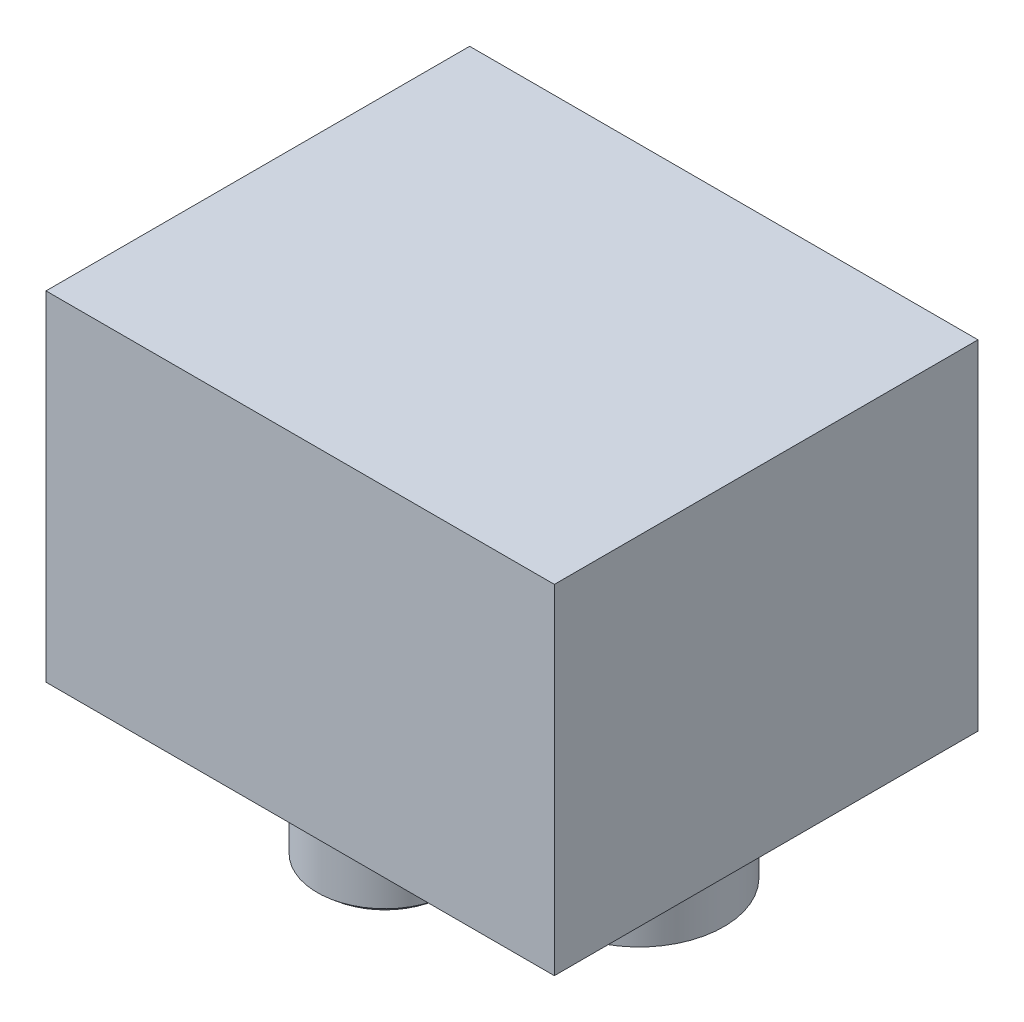
ISO-10303-21;
HEADER;
FILE_DESCRIPTION(('STEP AP214'),'2;1');
FILE_NAME('part.step','',(''),(''),'','','');
FILE_SCHEMA(('AUTOMOTIVE_DESIGN { 1 0 10303 214 1 1 1 1 }'));
ENDSEC;
DATA;
#1=APPLICATION_CONTEXT('core data for automotive mechanical design processes');
#2=APPLICATION_PROTOCOL_DEFINITION('international standard','automotive_design',2000,#1);
#3=PRODUCT_CONTEXT('',#1,'mechanical');
#4=PRODUCT('Part','Part','',(#3));
#5=PRODUCT_RELATED_PRODUCT_CATEGORY('part','',(#4));
#6=PRODUCT_DEFINITION_FORMATION('','',#4);
#7=PRODUCT_DEFINITION_CONTEXT('part definition',#1,'design');
#8=PRODUCT_DEFINITION('design','',#6,#7);
#9=PRODUCT_DEFINITION_SHAPE('','',#8);
#10=(LENGTH_UNIT() NAMED_UNIT(*) SI_UNIT(.MILLI.,.METRE.));
#11=(NAMED_UNIT(*) PLANE_ANGLE_UNIT() SI_UNIT($,.RADIAN.));
#12=(NAMED_UNIT(*) SI_UNIT($,.STERADIAN.) SOLID_ANGLE_UNIT());
#13=UNCERTAINTY_MEASURE_WITH_UNIT(LENGTH_MEASURE(1.E-05),#10,'distance_accuracy_value','');
#14=(GEOMETRIC_REPRESENTATION_CONTEXT(3) GLOBAL_UNCERTAINTY_ASSIGNED_CONTEXT((#13)) GLOBAL_UNIT_ASSIGNED_CONTEXT((#10,
#11,#12)) REPRESENTATION_CONTEXT('',''));
#15=CARTESIAN_POINT('',(0.,0.,0.));
#16=DIRECTION('',(0.,0.,1.));
#17=DIRECTION('',(1.,0.,0.));
#18=AXIS2_PLACEMENT_3D('',#15,#16,#17);
#19=CARTESIAN_POINT('',(0.,0.,31.75));
#20=DIRECTION('',(1.,0.,0.));
#21=DIRECTION('',(0.,0.,-1.));
#22=AXIS2_PLACEMENT_3D('',#19,#20,#21);
#23=PLANE('',#22);
#24=DIRECTION('',(0.,-1.,0.));
#25=VECTOR('',#24,1.);
#26=CARTESIAN_POINT('',(0.,0.,-31.75));
#27=LINE('',#26,#25);
#28=CARTESIAN_POINT('',(0.,50.8,-31.75));
#29=VERTEX_POINT('',#28);
#30=CARTESIAN_POINT('',(0.,0.,-31.75));
#31=VERTEX_POINT('',#30);
#32=EDGE_CURVE('E131',#29,#31,#27,.T.);
#33=ORIENTED_EDGE('',*,*,#32,.T.);
#34=DIRECTION('',(0.,0.,-1.));
#35=VECTOR('',#34,1.);
#36=CARTESIAN_POINT('',(0.,0.,31.75));
#37=LINE('',#36,#35);
#38=CARTESIAN_POINT('',(0.,0.,31.75));
#39=VERTEX_POINT('',#38);
#40=EDGE_CURVE('E60',#39,#31,#37,.T.);
#41=ORIENTED_EDGE('',*,*,#40,.F.);
#42=DIRECTION('',(0.,-1.,0.));
#43=VECTOR('',#42,1.);
#44=CARTESIAN_POINT('',(0.,0.,31.75));
#45=LINE('',#44,#43);
#46=CARTESIAN_POINT('',(0.,50.8,31.75));
#47=VERTEX_POINT('',#46);
#48=EDGE_CURVE('E132',#47,#39,#45,.T.);
#49=ORIENTED_EDGE('',*,*,#48,.F.);
#50=DIRECTION('',(0.,0.,-1.));
#51=VECTOR('',#50,1.);
#52=CARTESIAN_POINT('',(0.,50.8,31.75));
#53=LINE('',#52,#51);
#54=EDGE_CURVE('E142',#47,#29,#53,.T.);
#55=ORIENTED_EDGE('',*,*,#54,.T.);
#56=EDGE_LOOP('',(#33,#41,#49,#55));
#57=FACE_BOUND('',#56,.T.);
#58=ADVANCED_FACE('F51',(#57),#23,.F.);
#59=CARTESIAN_POINT('',(0.,0.,31.75));
#60=DIRECTION('',(0.,1.,0.));
#61=DIRECTION('',(0.,0.,1.));
#62=AXIS2_PLACEMENT_3D('',#59,#60,#61);
#63=PLANE('',#62);
#64=CARTESIAN_POINT('',(57.15,0.,0.));
#65=DIRECTION('',(0.,1.,0.));
#66=DIRECTION('',(0.,0.,1.));
#67=AXIS2_PLACEMENT_3D('',#64,#65,#66);
#68=CIRCLE('',#67,12.7);
#69=CARTESIAN_POINT('',(57.15,0.,12.7));
#70=VERTEX_POINT('',#69);
#71=EDGE_CURVE('E124',#70,#70,#68,.T.);
#72=ORIENTED_EDGE('',*,*,#71,.T.);
#73=EDGE_LOOP('',(#72));
#74=FACE_BOUND('',#73,.T.);
#75=CARTESIAN_POINT('',(19.05,0.,0.));
#76=DIRECTION('',(0.,1.,0.));
#77=DIRECTION('',(0.,0.,1.));
#78=AXIS2_PLACEMENT_3D('',#75,#76,#77);
#79=CIRCLE('',#78,6.35);
#80=CARTESIAN_POINT('',(19.05,0.,6.35));
#81=VERTEX_POINT('',#80);
#82=EDGE_CURVE('E11',#81,#81,#79,.F.);
#83=ORIENTED_EDGE('',*,*,#82,.F.);
#84=EDGE_LOOP('',(#83));
#85=FACE_BOUND('',#84,.T.);
#86=DIRECTION('',(1.,0.,0.));
#87=VECTOR('',#86,1.);
#88=CARTESIAN_POINT('',(0.,0.,-31.75));
#89=LINE('',#88,#87);
#90=CARTESIAN_POINT('',(76.2,0.,-31.75));
#91=VERTEX_POINT('',#90);
#92=EDGE_CURVE('E146',#31,#91,#89,.T.);
#93=ORIENTED_EDGE('',*,*,#92,.T.);
#94=DIRECTION('',(0.,0.,-1.));
#95=VECTOR('',#94,1.);
#96=CARTESIAN_POINT('',(76.2,0.,31.75));
#97=LINE('',#96,#95);
#98=CARTESIAN_POINT('',(76.2,0.,31.75));
#99=VERTEX_POINT('',#98);
#100=EDGE_CURVE('E158',#99,#91,#97,.T.);
#101=ORIENTED_EDGE('',*,*,#100,.F.);
#102=DIRECTION('',(1.,0.,0.));
#103=VECTOR('',#102,1.);
#104=CARTESIAN_POINT('',(0.,0.,31.75));
#105=LINE('',#104,#103);
#106=EDGE_CURVE('E100',#39,#99,#105,.T.);
#107=ORIENTED_EDGE('',*,*,#106,.F.);
#108=ORIENTED_EDGE('',*,*,#40,.T.);
#109=EDGE_LOOP('',(#93,#101,#107,#108));
#110=FACE_BOUND('',#109,.T.);
#111=ADVANCED_FACE('F162',(#74,#85,#110),#63,.F.);
#112=CARTESIAN_POINT('',(76.2,0.,31.75));
#113=DIRECTION('',(-1.,0.,0.));
#114=DIRECTION('',(0.,0.,1.));
#115=AXIS2_PLACEMENT_3D('',#112,#113,#114);
#116=PLANE('',#115);
#117=DIRECTION('',(0.,1.,0.));
#118=VECTOR('',#117,1.);
#119=CARTESIAN_POINT('',(76.2,0.,-31.75));
#120=LINE('',#119,#118);
#121=CARTESIAN_POINT('',(76.2,50.8,-31.75));
#122=VERTEX_POINT('',#121);
#123=EDGE_CURVE('E86',#91,#122,#120,.T.);
#124=ORIENTED_EDGE('',*,*,#123,.T.);
#125=DIRECTION('',(0.,0.,-1.));
#126=VECTOR('',#125,1.);
#127=CARTESIAN_POINT('',(76.2,50.8,31.75));
#128=LINE('',#127,#126);
#129=CARTESIAN_POINT('',(76.2,50.8,31.75));
#130=VERTEX_POINT('',#129);
#131=EDGE_CURVE('E155',#130,#122,#128,.T.);
#132=ORIENTED_EDGE('',*,*,#131,.F.);
#133=DIRECTION('',(0.,1.,0.));
#134=VECTOR('',#133,1.);
#135=CARTESIAN_POINT('',(76.2,0.,31.75));
#136=LINE('',#135,#134);
#137=EDGE_CURVE('E137',#99,#130,#136,.T.);
#138=ORIENTED_EDGE('',*,*,#137,.F.);
#139=ORIENTED_EDGE('',*,*,#100,.T.);
#140=EDGE_LOOP('',(#124,#132,#138,#139));
#141=FACE_BOUND('',#140,.T.);
#142=ADVANCED_FACE('F188',(#141),#116,.F.);
#143=CARTESIAN_POINT('',(0.,50.8,31.75));
#144=DIRECTION('',(0.,-1.,0.));
#145=DIRECTION('',(0.,0.,-1.));
#146=AXIS2_PLACEMENT_3D('',#143,#144,#145);
#147=PLANE('',#146);
#148=DIRECTION('',(-1.,0.,0.));
#149=VECTOR('',#148,1.);
#150=CARTESIAN_POINT('',(0.,50.8,-31.75));
#151=LINE('',#150,#149);
#152=EDGE_CURVE('E92',#122,#29,#151,.T.);
#153=ORIENTED_EDGE('',*,*,#152,.T.);
#154=ORIENTED_EDGE('',*,*,#54,.F.);
#155=DIRECTION('',(-1.,0.,0.));
#156=VECTOR('',#155,1.);
#157=CARTESIAN_POINT('',(0.,50.8,31.75));
#158=LINE('',#157,#156);
#159=EDGE_CURVE('E68',#130,#47,#158,.T.);
#160=ORIENTED_EDGE('',*,*,#159,.F.);
#161=ORIENTED_EDGE('',*,*,#131,.T.);
#162=EDGE_LOOP('',(#153,#154,#160,#161));
#163=FACE_BOUND('',#162,.T.);
#164=ADVANCED_FACE('F180',(#163),#147,.F.);
#165=CARTESIAN_POINT('',(0.,0.,31.75));
#166=DIRECTION('',(0.,0.,-1.));
#167=DIRECTION('',(-1.,0.,0.));
#168=AXIS2_PLACEMENT_3D('',#165,#166,#167);
#169=PLANE('',#168);
#170=ORIENTED_EDGE('',*,*,#48,.T.);
#171=ORIENTED_EDGE('',*,*,#106,.T.);
#172=ORIENTED_EDGE('',*,*,#137,.T.);
#173=ORIENTED_EDGE('',*,*,#159,.T.);
#174=EDGE_LOOP('',(#170,#171,#172,#173));
#175=FACE_BOUND('',#174,.T.);
#176=ADVANCED_FACE('F170',(#175),#169,.F.);
#177=CARTESIAN_POINT('',(0.,0.,-31.75));
#178=DIRECTION('',(0.,0.,-1.));
#179=DIRECTION('',(-1.,0.,0.));
#180=AXIS2_PLACEMENT_3D('',#177,#178,#179);
#181=PLANE('',#180);
#182=ORIENTED_EDGE('',*,*,#32,.F.);
#183=ORIENTED_EDGE('',*,*,#152,.F.);
#184=ORIENTED_EDGE('',*,*,#123,.F.);
#185=ORIENTED_EDGE('',*,*,#92,.F.);
#186=EDGE_LOOP('',(#182,#183,#184,#185));
#187=FACE_BOUND('',#186,.T.);
#188=ADVANCED_FACE('F167',(#187),#181,.T.);
#189=CARTESIAN_POINT('',(19.05,-28.575,0.));
#190=DIRECTION('',(0.,-1.,0.));
#191=DIRECTION('',(0.,0.,-1.));
#192=AXIS2_PLACEMENT_3D('',#189,#190,#191);
#193=CYLINDRICAL_SURFACE('',#192,6.35);
#194=CARTESIAN_POINT('',(19.05,-12.7,0.));
#195=DIRECTION('',(0.,-1.,0.));
#196=DIRECTION('',(0.,0.,-1.));
#197=AXIS2_PLACEMENT_3D('',#194,#195,#196);
#198=CIRCLE('',#197,6.35);
#199=CARTESIAN_POINT('',(19.05,-12.7,-6.35));
#200=VERTEX_POINT('',#199);
#201=EDGE_CURVE('E121',#200,#200,#198,.T.);
#202=ORIENTED_EDGE('',*,*,#201,.F.);
#203=EDGE_LOOP('',(#202));
#204=FACE_BOUND('',#203,.T.);
#205=ORIENTED_EDGE('',*,*,#82,.T.);
#206=EDGE_LOOP('',(#205));
#207=FACE_BOUND('',#206,.T.);
#208=ADVANCED_FACE('F169',(#204,#207),#193,.T.);
#209=CARTESIAN_POINT('',(12.7,-12.7,0.));
#210=DIRECTION('',(0.,-1.,0.));
#211=DIRECTION('',(0.,0.,-1.));
#212=AXIS2_PLACEMENT_3D('',#209,#210,#211);
#213=PLANE('',#212);
#214=CARTESIAN_POINT('',(19.05,-12.7,0.));
#215=DIRECTION('',(0.,-1.,0.));
#216=DIRECTION('',(0.,0.,-1.));
#217=AXIS2_PLACEMENT_3D('',#214,#215,#216);
#218=CIRCLE('',#217,10.16);
#219=CARTESIAN_POINT('',(19.05,-12.7,-10.16));
#220=VERTEX_POINT('',#219);
#221=EDGE_CURVE('E115',#220,#220,#218,.T.);
#222=ORIENTED_EDGE('',*,*,#221,.F.);
#223=EDGE_LOOP('',(#222));
#224=FACE_BOUND('',#223,.T.);
#225=ORIENTED_EDGE('',*,*,#201,.T.);
#226=EDGE_LOOP('',(#225));
#227=FACE_BOUND('',#226,.T.);
#228=ADVANCED_FACE('F177',(#224,#227),#213,.F.);
#229=CARTESIAN_POINT('',(19.05,-28.575,0.));
#230=DIRECTION('',(0.,-1.,0.));
#231=DIRECTION('',(0.,0.,-1.));
#232=AXIS2_PLACEMENT_3D('',#229,#230,#231);
#233=CYLINDRICAL_SURFACE('',#232,10.16);
#234=CARTESIAN_POINT('',(19.05,-28.575,0.));
#235=DIRECTION('',(0.,-1.,0.));
#236=DIRECTION('',(0.,0.,-1.));
#237=AXIS2_PLACEMENT_3D('',#234,#235,#236);
#238=CIRCLE('',#237,10.16);
#239=CARTESIAN_POINT('',(19.05,-28.575,-10.16));
#240=VERTEX_POINT('',#239);
#241=EDGE_CURVE('E112',#240,#240,#238,.T.);
#242=ORIENTED_EDGE('',*,*,#241,.F.);
#243=EDGE_LOOP('',(#242));
#244=FACE_BOUND('',#243,.T.);
#245=ORIENTED_EDGE('',*,*,#221,.T.);
#246=EDGE_LOOP('',(#245));
#247=FACE_BOUND('',#246,.T.);
#248=ADVANCED_FACE('F108',(#244,#247),#233,.T.);
#249=CARTESIAN_POINT('',(19.05,-19.8804311202188,-1.86685347506839));
#250=DIRECTION('',(-1.,0.,0.));
#251=DIRECTION('',(0.,0.,-1.));
#252=AXIS2_PLACEMENT_3D('',#249,#250,#251);
#253=CIRCLE('',#252,12.0154819832266);
#254=TRIMMED_CURVE('',#253,(PARAMETER_VALUE(-1.72679899480816)),
(PARAMETER_VALUE(1.72679899480816)),.T.,.PARAMETER.);
#255=CARTESIAN_POINT('',(19.05,-19.8804311202188,0.));
#256=DIRECTION('',(0.,-1.,0.));
#257=AXIS1_PLACEMENT('',#255,#256);
#258=SURFACE_OF_REVOLUTION('',#254,#257);
#259=CARTESIAN_POINT('',(19.05,-31.75,0.));
#260=VERTEX_POINT('',#259);
#261=VERTEX_LOOP('',#260);
#262=FACE_BOUND('',#261,.T.);
#263=ORIENTED_EDGE('',*,*,#241,.T.);
#264=EDGE_LOOP('',(#263));
#265=FACE_BOUND('',#264,.T.);
#266=ADVANCED_FACE('F104',(#262,#265),#258,.T.);
#267=CARTESIAN_POINT('',(57.15,0.,0.));
#268=DIRECTION('',(0.,1.,0.));
#269=DIRECTION('',(0.,0.,1.));
#270=AXIS2_PLACEMENT_3D('',#267,#268,#269);
#271=CYLINDRICAL_SURFACE('',#270,12.7);
#272=CARTESIAN_POINT('',(57.15,-12.7,0.));
#273=DIRECTION('',(0.,1.,0.));
#274=DIRECTION('',(0.,0.,1.));
#275=AXIS2_PLACEMENT_3D('',#272,#273,#274);
#276=CIRCLE('',#275,12.7);
#277=CARTESIAN_POINT('',(57.15,-12.7,12.7));
#278=VERTEX_POINT('',#277);
#279=EDGE_CURVE('E116',#278,#278,#276,.T.);
#280=ORIENTED_EDGE('',*,*,#279,.T.);
#281=EDGE_LOOP('',(#280));
#282=FACE_BOUND('',#281,.T.);
#283=ORIENTED_EDGE('',*,*,#71,.F.);
#284=EDGE_LOOP('',(#283));
#285=FACE_BOUND('',#284,.T.);
#286=ADVANCED_FACE('F107',(#282,#285),#271,.T.);
#287=CARTESIAN_POINT('',(44.45,-12.7,0.));
#288=DIRECTION('',(0.,-1.,0.));
#289=DIRECTION('',(0.,0.,-1.));
#290=AXIS2_PLACEMENT_3D('',#287,#288,#289);
#291=PLANE('',#290);
#292=ORIENTED_EDGE('',*,*,#279,.F.);
#293=EDGE_LOOP('',(#292));
#294=FACE_BOUND('',#293,.T.);
#295=ADVANCED_FACE('F254',(#294),#291,.T.);
#296=CLOSED_SHELL('',(#58,#111,#142,#164,#176,#188,#208,#228,#248,#266,#286,#295));
#297=MANIFOLD_SOLID_BREP('B2',#296);
#298=ADVANCED_BREP_SHAPE_REPRESENTATION('',(#18,#297),#14);
#299=SHAPE_DEFINITION_REPRESENTATION(#9,#298);
ENDSEC;
END-ISO-10303-21;
